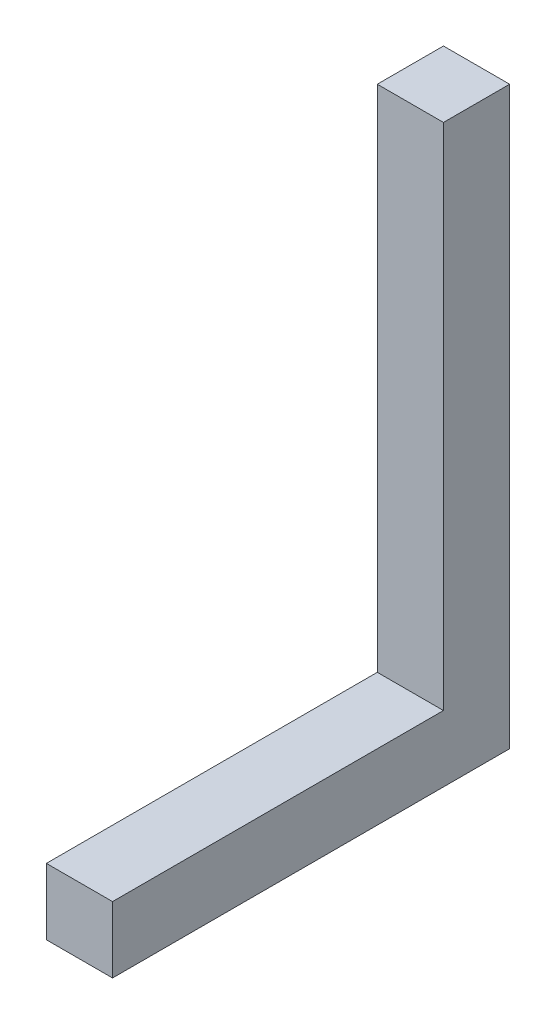
ISO-10303-21;
HEADER;
FILE_DESCRIPTION(('STEP AP214'),'2;1');
FILE_NAME('part.step','',(''),(''),'','','');
FILE_SCHEMA(('AUTOMOTIVE_DESIGN { 1 0 10303 214 1 1 1 1 }'));
ENDSEC;
DATA;
#1=APPLICATION_CONTEXT('core data for automotive mechanical design processes');
#2=APPLICATION_PROTOCOL_DEFINITION('international standard','automotive_design',2000,#1);
#3=PRODUCT_CONTEXT('',#1,'mechanical');
#4=PRODUCT('Part','Part','',(#3));
#5=PRODUCT_RELATED_PRODUCT_CATEGORY('part','',(#4));
#6=PRODUCT_DEFINITION_FORMATION('','',#4);
#7=PRODUCT_DEFINITION_CONTEXT('part definition',#1,'design');
#8=PRODUCT_DEFINITION('design','',#6,#7);
#9=PRODUCT_DEFINITION_SHAPE('','',#8);
#10=(LENGTH_UNIT() NAMED_UNIT(*) SI_UNIT(.MILLI.,.METRE.));
#11=(NAMED_UNIT(*) PLANE_ANGLE_UNIT() SI_UNIT($,.RADIAN.));
#12=(NAMED_UNIT(*) SI_UNIT($,.STERADIAN.) SOLID_ANGLE_UNIT());
#13=UNCERTAINTY_MEASURE_WITH_UNIT(LENGTH_MEASURE(1.E-05),#10,'distance_accuracy_value','');
#14=(GEOMETRIC_REPRESENTATION_CONTEXT(3) GLOBAL_UNCERTAINTY_ASSIGNED_CONTEXT((#13)) GLOBAL_UNIT_ASSIGNED_CONTEXT((#10,
#11,#12)) REPRESENTATION_CONTEXT('',''));
#15=CARTESIAN_POINT('',(0.,0.,0.));
#16=DIRECTION('',(0.,0.,1.));
#17=DIRECTION('',(1.,0.,0.));
#18=AXIS2_PLACEMENT_3D('',#15,#16,#17);
#19=CARTESIAN_POINT('',(-5.75,5.75,57.5));
#20=DIRECTION('',(1.,0.,0.));
#21=DIRECTION('',(0.,1.,0.));
#22=AXIS2_PLACEMENT_3D('',#19,#20,#21);
#23=PLANE('',#22);
#24=DIRECTION('',(0.,0.,-1.));
#25=VECTOR('',#24,1.);
#26=CARTESIAN_POINT('',(-5.75,5.75,57.5));
#27=LINE('',#26,#25);
#28=CARTESIAN_POINT('',(-5.75,5.75,57.5));
#29=VERTEX_POINT('',#28);
#30=CARTESIAN_POINT('',(-5.75,5.75,0.));
#31=VERTEX_POINT('',#30);
#32=EDGE_CURVE('E140',#29,#31,#27,.T.);
#33=ORIENTED_EDGE('',*,*,#32,.T.);
#34=DIRECTION('',(0.,-1.,0.));
#35=VECTOR('',#34,1.);
#36=CARTESIAN_POINT('',(-5.75,94.25,0.));
#37=LINE('',#36,#35);
#38=CARTESIAN_POINT('',(-5.75,94.25,0.));
#39=VERTEX_POINT('',#38);
#40=EDGE_CURVE('E127',#39,#31,#37,.T.);
#41=ORIENTED_EDGE('',*,*,#40,.F.);
#42=DIRECTION('',(0.,0.,1.));
#43=VECTOR('',#42,1.);
#44=CARTESIAN_POINT('',(-5.75,94.25,57.5));
#45=LINE('',#44,#43);
#46=CARTESIAN_POINT('',(-5.75,94.25,-11.5));
#47=VERTEX_POINT('',#46);
#48=EDGE_CURVE('E102',#47,#39,#45,.T.);
#49=ORIENTED_EDGE('',*,*,#48,.F.);
#50=DIRECTION('',(0.,-1.,0.));
#51=VECTOR('',#50,1.);
#52=CARTESIAN_POINT('',(-5.75,94.25,-11.5));
#53=LINE('',#52,#51);
#54=CARTESIAN_POINT('',(-5.75,-5.75,-11.5));
#55=VERTEX_POINT('',#54);
#56=EDGE_CURVE('E98',#47,#55,#53,.T.);
#57=ORIENTED_EDGE('',*,*,#56,.T.);
#58=DIRECTION('',(0.,0.,-1.));
#59=VECTOR('',#58,1.);
#60=CARTESIAN_POINT('',(-5.75,-5.75,57.5));
#61=LINE('',#60,#59);
#62=CARTESIAN_POINT('',(-5.75,-5.75,57.5));
#63=VERTEX_POINT('',#62);
#64=EDGE_CURVE('E11',#63,#55,#61,.T.);
#65=ORIENTED_EDGE('',*,*,#64,.F.);
#66=DIRECTION('',(0.,-1.,0.));
#67=VECTOR('',#66,1.);
#68=CARTESIAN_POINT('',(-5.75,5.75,57.5));
#69=LINE('',#68,#67);
#70=EDGE_CURVE('E125',#29,#63,#69,.T.);
#71=ORIENTED_EDGE('',*,*,#70,.F.);
#72=EDGE_LOOP('',(#33,#41,#49,#57,#65,#71));
#73=FACE_BOUND('',#72,.T.);
#74=ADVANCED_FACE('F43',(#73),#23,.F.);
#75=CARTESIAN_POINT('',(5.75,-5.75,57.5));
#76=DIRECTION('',(0.,1.,0.));
#77=DIRECTION('',(-1.,0.,0.));
#78=AXIS2_PLACEMENT_3D('',#75,#76,#77);
#79=PLANE('',#78);
#80=ORIENTED_EDGE('',*,*,#64,.T.);
#81=DIRECTION('',(-1.,0.,0.));
#82=VECTOR('',#81,1.);
#83=CARTESIAN_POINT('',(5.74999999999999,-5.75,-11.5));
#84=LINE('',#83,#82);
#85=CARTESIAN_POINT('',(5.75,-5.75,-11.5));
#86=VERTEX_POINT('',#85);
#87=EDGE_CURVE('E113',#86,#55,#84,.T.);
#88=ORIENTED_EDGE('',*,*,#87,.F.);
#89=DIRECTION('',(0.,0.,-1.));
#90=VECTOR('',#89,1.);
#91=CARTESIAN_POINT('',(5.75,-5.75,57.5));
#92=LINE('',#91,#90);
#93=CARTESIAN_POINT('',(5.75,-5.75,57.5));
#94=VERTEX_POINT('',#93);
#95=EDGE_CURVE('E52',#94,#86,#92,.T.);
#96=ORIENTED_EDGE('',*,*,#95,.F.);
#97=DIRECTION('',(1.,0.,0.));
#98=VECTOR('',#97,1.);
#99=CARTESIAN_POINT('',(5.75,-5.75,57.5));
#100=LINE('',#99,#98);
#101=EDGE_CURVE('E133',#63,#94,#100,.T.);
#102=ORIENTED_EDGE('',*,*,#101,.F.);
#103=EDGE_LOOP('',(#80,#88,#96,#102));
#104=FACE_BOUND('',#103,.T.);
#105=ADVANCED_FACE('F178',(#104),#79,.F.);
#106=CARTESIAN_POINT('',(5.75,5.75,57.5));
#107=DIRECTION('',(-1.,0.,0.));
#108=DIRECTION('',(0.,-1.,0.));
#109=AXIS2_PLACEMENT_3D('',#106,#107,#108);
#110=PLANE('',#109);
#111=ORIENTED_EDGE('',*,*,#95,.T.);
#112=DIRECTION('',(0.,-1.,0.));
#113=VECTOR('',#112,1.);
#114=CARTESIAN_POINT('',(5.75,94.25,-11.5));
#115=LINE('',#114,#113);
#116=CARTESIAN_POINT('',(5.75,94.25,-11.5));
#117=VERTEX_POINT('',#116);
#118=EDGE_CURVE('E96',#117,#86,#115,.T.);
#119=ORIENTED_EDGE('',*,*,#118,.F.);
#120=DIRECTION('',(0.,0.,-1.));
#121=VECTOR('',#120,1.);
#122=CARTESIAN_POINT('',(5.75,94.25,57.5));
#123=LINE('',#122,#121);
#124=CARTESIAN_POINT('',(5.75,94.25,0.));
#125=VERTEX_POINT('',#124);
#126=EDGE_CURVE('E103',#125,#117,#123,.T.);
#127=ORIENTED_EDGE('',*,*,#126,.F.);
#128=DIRECTION('',(0.,-1.,0.));
#129=VECTOR('',#128,1.);
#130=CARTESIAN_POINT('',(5.75,94.25,0.));
#131=LINE('',#130,#129);
#132=CARTESIAN_POINT('',(5.75,5.75000000000001,0.));
#133=VERTEX_POINT('',#132);
#134=EDGE_CURVE('E152',#125,#133,#131,.T.);
#135=ORIENTED_EDGE('',*,*,#134,.T.);
#136=DIRECTION('',(0.,0.,-1.));
#137=VECTOR('',#136,1.);
#138=CARTESIAN_POINT('',(5.75,5.75,57.5));
#139=LINE('',#138,#137);
#140=CARTESIAN_POINT('',(5.75,5.75,57.5));
#141=VERTEX_POINT('',#140);
#142=EDGE_CURVE('E145',#141,#133,#139,.T.);
#143=ORIENTED_EDGE('',*,*,#142,.F.);
#144=DIRECTION('',(0.,1.,0.));
#145=VECTOR('',#144,1.);
#146=CARTESIAN_POINT('',(5.75,5.75,57.5));
#147=LINE('',#146,#145);
#148=EDGE_CURVE('E136',#94,#141,#147,.T.);
#149=ORIENTED_EDGE('',*,*,#148,.F.);
#150=EDGE_LOOP('',(#111,#119,#127,#135,#143,#149));
#151=FACE_BOUND('',#150,.T.);
#152=ADVANCED_FACE('F115',(#151),#110,.F.);
#153=CARTESIAN_POINT('',(5.75,5.75,57.5));
#154=DIRECTION('',(0.,-1.,0.));
#155=DIRECTION('',(1.,0.,0.));
#156=AXIS2_PLACEMENT_3D('',#153,#154,#155);
#157=PLANE('',#156);
#158=DIRECTION('',(-1.,0.,0.));
#159=VECTOR('',#158,1.);
#160=CARTESIAN_POINT('',(5.75,5.75,0.));
#161=LINE('',#160,#159);
#162=EDGE_CURVE('E120',#133,#31,#161,.T.);
#163=ORIENTED_EDGE('',*,*,#162,.T.);
#164=ORIENTED_EDGE('',*,*,#32,.F.);
#165=DIRECTION('',(-1.,0.,0.));
#166=VECTOR('',#165,1.);
#167=CARTESIAN_POINT('',(5.75,5.75,57.5));
#168=LINE('',#167,#166);
#169=EDGE_CURVE('E59',#141,#29,#168,.T.);
#170=ORIENTED_EDGE('',*,*,#169,.F.);
#171=ORIENTED_EDGE('',*,*,#142,.T.);
#172=EDGE_LOOP('',(#163,#164,#170,#171));
#173=FACE_BOUND('',#172,.T.);
#174=ADVANCED_FACE('F151',(#173),#157,.F.);
#175=CARTESIAN_POINT('',(0.,0.,57.5));
#176=DIRECTION('',(0.,0.,-1.));
#177=DIRECTION('',(-1.,0.,0.));
#178=AXIS2_PLACEMENT_3D('',#175,#176,#177);
#179=PLANE('',#178);
#180=ORIENTED_EDGE('',*,*,#70,.T.);
#181=ORIENTED_EDGE('',*,*,#101,.T.);
#182=ORIENTED_EDGE('',*,*,#148,.T.);
#183=ORIENTED_EDGE('',*,*,#169,.T.);
#184=EDGE_LOOP('',(#180,#181,#182,#183));
#185=FACE_BOUND('',#184,.T.);
#186=ADVANCED_FACE('F175',(#185),#179,.F.);
#187=CARTESIAN_POINT('',(5.74999999999999,94.25,-11.5));
#188=DIRECTION('',(0.,0.,1.));
#189=DIRECTION('',(1.,0.,0.));
#190=AXIS2_PLACEMENT_3D('',#187,#188,#189);
#191=PLANE('',#190);
#192=ORIENTED_EDGE('',*,*,#87,.T.);
#193=ORIENTED_EDGE('',*,*,#56,.F.);
#194=DIRECTION('',(-1.,0.,0.));
#195=VECTOR('',#194,1.);
#196=CARTESIAN_POINT('',(5.74999999999999,94.25,-11.5));
#197=LINE('',#196,#195);
#198=EDGE_CURVE('E91',#117,#47,#197,.T.);
#199=ORIENTED_EDGE('',*,*,#198,.F.);
#200=ORIENTED_EDGE('',*,*,#118,.T.);
#201=EDGE_LOOP('',(#192,#193,#199,#200));
#202=FACE_BOUND('',#201,.T.);
#203=ADVANCED_FACE('F94',(#202),#191,.F.);
#204=CARTESIAN_POINT('',(5.75,94.25,0.));
#205=DIRECTION('',(0.,0.,-1.));
#206=DIRECTION('',(-1.,0.,0.));
#207=AXIS2_PLACEMENT_3D('',#204,#205,#206);
#208=PLANE('',#207);
#209=ORIENTED_EDGE('',*,*,#162,.F.);
#210=ORIENTED_EDGE('',*,*,#134,.F.);
#211=DIRECTION('',(1.,0.,0.));
#212=VECTOR('',#211,1.);
#213=CARTESIAN_POINT('',(5.75,94.25,0.));
#214=LINE('',#213,#212);
#215=EDGE_CURVE('E108',#39,#125,#214,.T.);
#216=ORIENTED_EDGE('',*,*,#215,.F.);
#217=ORIENTED_EDGE('',*,*,#40,.T.);
#218=EDGE_LOOP('',(#209,#210,#216,#217));
#219=FACE_BOUND('',#218,.T.);
#220=ADVANCED_FACE('F167',(#219),#208,.F.);
#221=CARTESIAN_POINT('',(0.,94.25,0.));
#222=DIRECTION('',(0.,1.,0.));
#223=DIRECTION('',(-1.,0.,0.));
#224=AXIS2_PLACEMENT_3D('',#221,#222,#223);
#225=PLANE('',#224);
#226=ORIENTED_EDGE('',*,*,#126,.T.);
#227=ORIENTED_EDGE('',*,*,#198,.T.);
#228=ORIENTED_EDGE('',*,*,#48,.T.);
#229=ORIENTED_EDGE('',*,*,#215,.T.);
#230=EDGE_LOOP('',(#226,#227,#228,#229));
#231=FACE_BOUND('',#230,.T.);
#232=ADVANCED_FACE('F106',(#231),#225,.T.);
#233=CLOSED_SHELL('',(#74,#105,#152,#174,#186,#203,#220,#232));
#234=MANIFOLD_SOLID_BREP('B2',#233);
#235=ADVANCED_BREP_SHAPE_REPRESENTATION('',(#18,#234),#14);
#236=SHAPE_DEFINITION_REPRESENTATION(#9,#235);
ENDSEC;
END-ISO-10303-21;
